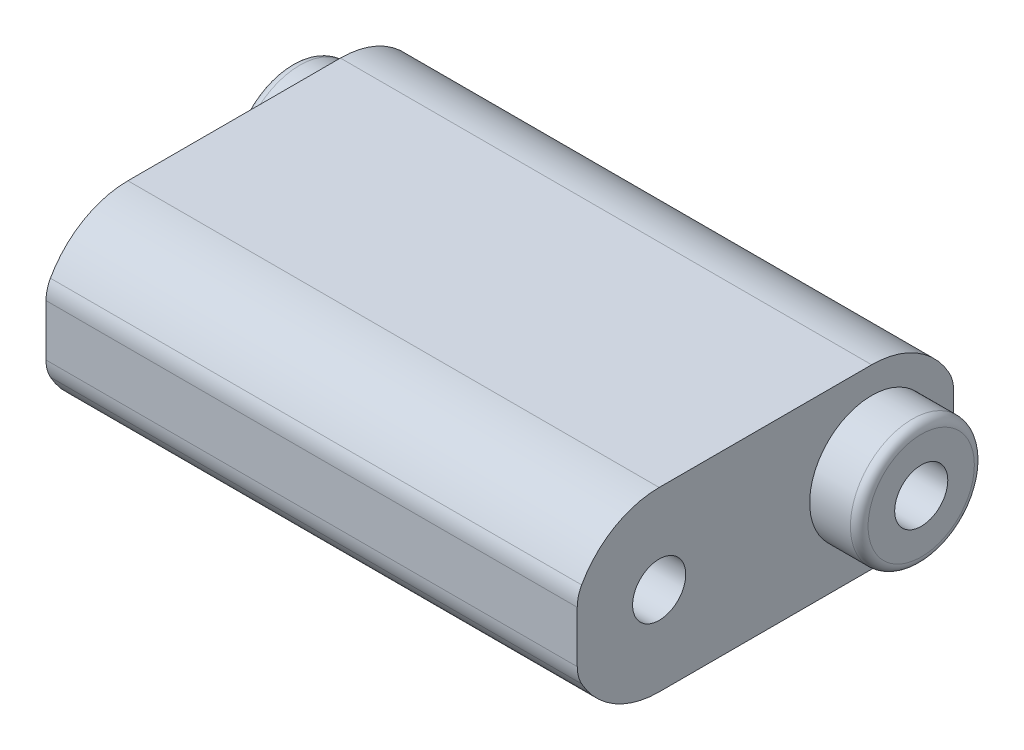
ISO-10303-21;
HEADER;
FILE_DESCRIPTION(('STEP AP214'),'2;1');
FILE_NAME('part.step','',(''),(''),'','','');
FILE_SCHEMA(('AUTOMOTIVE_DESIGN { 1 0 10303 214 1 1 1 1 }'));
ENDSEC;
DATA;
#1=APPLICATION_CONTEXT('core data for automotive mechanical design processes');
#2=APPLICATION_PROTOCOL_DEFINITION('international standard','automotive_design',2000,#1);
#3=PRODUCT_CONTEXT('',#1,'mechanical');
#4=PRODUCT('Part','Part','',(#3));
#5=PRODUCT_RELATED_PRODUCT_CATEGORY('part','',(#4));
#6=PRODUCT_DEFINITION_FORMATION('','',#4);
#7=PRODUCT_DEFINITION_CONTEXT('part definition',#1,'design');
#8=PRODUCT_DEFINITION('design','',#6,#7);
#9=PRODUCT_DEFINITION_SHAPE('','',#8);
#10=(LENGTH_UNIT() NAMED_UNIT(*) SI_UNIT(.MILLI.,.METRE.));
#11=(NAMED_UNIT(*) PLANE_ANGLE_UNIT() SI_UNIT($,.RADIAN.));
#12=(NAMED_UNIT(*) SI_UNIT($,.STERADIAN.) SOLID_ANGLE_UNIT());
#13=UNCERTAINTY_MEASURE_WITH_UNIT(LENGTH_MEASURE(1.E-05),#10,'distance_accuracy_value','');
#14=(GEOMETRIC_REPRESENTATION_CONTEXT(3) GLOBAL_UNCERTAINTY_ASSIGNED_CONTEXT((#13)) GLOBAL_UNIT_ASSIGNED_CONTEXT((#10,
#11,#12)) REPRESENTATION_CONTEXT('',''));
#15=CARTESIAN_POINT('',(0.,0.,0.));
#16=DIRECTION('',(0.,0.,1.));
#17=DIRECTION('',(1.,0.,0.));
#18=AXIS2_PLACEMENT_3D('',#15,#16,#17);
#19=CARTESIAN_POINT('',(300.,0.,0.));
#20=DIRECTION('',(1.,0.,0.));
#21=DIRECTION('',(0.,0.,-1.));
#22=AXIS2_PLACEMENT_3D('',#19,#20,#21);
#23=PLANE('',#22);
#24=DIRECTION('',(0.,-1.,0.));
#25=VECTOR('',#24,1.);
#26=CARTESIAN_POINT('',(300.,0.,106.249324319389));
#27=LINE('',#26,#25);
#28=CARTESIAN_POINT('',(300.,14.5249087011089,106.249324319389));
#29=VERTEX_POINT('',#28);
#30=CARTESIAN_POINT('',(300.,-14.5249087011089,106.249324319389));
#31=VERTEX_POINT('',#30);
#32=EDGE_CURVE('E171',#29,#31,#27,.T.);
#33=ORIENTED_EDGE('',*,*,#32,.T.);
#34=CARTESIAN_POINT('',(300.,-14.5249087011089,86.2493243193887));
#35=DIRECTION('',(1.,0.,0.));
#36=DIRECTION('',(0.,0.,-1.));
#37=AXIS2_PLACEMENT_3D('',#34,#35,#36);
#38=CIRCLE('',#37,20.);
#39=CARTESIAN_POINT('',(300.,-24.2081811685148,103.748873865648));
#40=VERTEX_POINT('',#39);
#41=EDGE_CURVE('E140',#31,#40,#38,.T.);
#42=ORIENTED_EDGE('',*,*,#41,.T.);
#43=CARTESIAN_POINT('',(300.,0.,60.));
#44=DIRECTION('',(1.,0.,0.));
#45=DIRECTION('',(0.,0.,-1.));
#46=AXIS2_PLACEMENT_3D('',#43,#44,#45);
#47=CIRCLE('',#46,50.);
#48=CARTESIAN_POINT('',(300.,-50.,60.));
#49=VERTEX_POINT('',#48);
#50=EDGE_CURVE('E132',#40,#49,#47,.T.);
#51=ORIENTED_EDGE('',*,*,#50,.T.);
#52=DIRECTION('',(0.,0.,1.));
#53=VECTOR('',#52,1.);
#54=CARTESIAN_POINT('',(300.,-50.,0.));
#55=LINE('',#54,#53);
#56=CARTESIAN_POINT('',(300.,-50.,-60.));
#57=VERTEX_POINT('',#56);
#58=EDGE_CURVE('E138',#57,#49,#55,.T.);
#59=ORIENTED_EDGE('',*,*,#58,.F.);
#60=CARTESIAN_POINT('',(300.,0.,-60.));
#61=DIRECTION('',(1.,0.,0.));
#62=DIRECTION('',(0.,0.,-1.));
#63=AXIS2_PLACEMENT_3D('',#60,#61,#62);
#64=CIRCLE('',#63,50.);
#65=CARTESIAN_POINT('',(300.,-24.2081811685148,-103.748873865648));
#66=VERTEX_POINT('',#65);
#67=EDGE_CURVE('E160',#57,#66,#64,.T.);
#68=ORIENTED_EDGE('',*,*,#67,.T.);
#69=CARTESIAN_POINT('',(300.,-14.5249087011089,-86.2493243193887));
#70=DIRECTION('',(1.,0.,0.));
#71=DIRECTION('',(0.,0.,-1.));
#72=AXIS2_PLACEMENT_3D('',#69,#70,#71);
#73=CIRCLE('',#72,20.);
#74=CARTESIAN_POINT('',(300.,-14.5249087011089,-106.249324319389));
#75=VERTEX_POINT('',#74);
#76=EDGE_CURVE('E226',#66,#75,#73,.T.);
#77=ORIENTED_EDGE('',*,*,#76,.T.);
#78=DIRECTION('',(0.,-1.,0.));
#79=VECTOR('',#78,1.);
#80=CARTESIAN_POINT('',(300.,0.,-106.249324319389));
#81=LINE('',#80,#79);
#82=CARTESIAN_POINT('',(300.,14.5249087011089,-106.249324319389));
#83=VERTEX_POINT('',#82);
#84=EDGE_CURVE('E162',#83,#75,#81,.T.);
#85=ORIENTED_EDGE('',*,*,#84,.F.);
#86=CARTESIAN_POINT('',(300.,14.5249087011089,-86.2493243193887));
#87=DIRECTION('',(1.,0.,0.));
#88=DIRECTION('',(0.,0.,-1.));
#89=AXIS2_PLACEMENT_3D('',#86,#87,#88);
#90=CIRCLE('',#89,20.);
#91=CARTESIAN_POINT('',(300.,24.2081811685149,-103.748873865648));
#92=VERTEX_POINT('',#91);
#93=EDGE_CURVE('E64',#83,#92,#90,.T.);
#94=ORIENTED_EDGE('',*,*,#93,.T.);
#95=CARTESIAN_POINT('',(300.,50.,-60.));
#96=VERTEX_POINT('',#95);
#97=EDGE_CURVE('E164',#92,#96,#64,.T.);
#98=ORIENTED_EDGE('',*,*,#97,.T.);
#99=DIRECTION('',(0.,0.,1.));
#100=VECTOR('',#99,1.);
#101=CARTESIAN_POINT('',(300.,50.,0.));
#102=LINE('',#101,#100);
#103=CARTESIAN_POINT('',(300.,50.,60.));
#104=VERTEX_POINT('',#103);
#105=EDGE_CURVE('E169',#96,#104,#102,.T.);
#106=ORIENTED_EDGE('',*,*,#105,.T.);
#107=CARTESIAN_POINT('',(300.,24.2081811685148,103.748873865648));
#108=VERTEX_POINT('',#107);
#109=EDGE_CURVE('E146',#104,#108,#47,.T.);
#110=ORIENTED_EDGE('',*,*,#109,.T.);
#111=CARTESIAN_POINT('',(300.,14.5249087011089,86.2493243193887));
#112=DIRECTION('',(1.,0.,0.));
#113=DIRECTION('',(0.,0.,-1.));
#114=AXIS2_PLACEMENT_3D('',#111,#112,#113);
#115=CIRCLE('',#114,20.);
#116=EDGE_CURVE('E228',#108,#29,#115,.T.);
#117=ORIENTED_EDGE('',*,*,#116,.T.);
#118=EDGE_LOOP('',(#33,#42,#51,#59,#68,#77,#85,#94,#98,#106,#110,#117));
#119=FACE_BOUND('',#118,.T.);
#120=CARTESIAN_POINT('',(300.,0.,60.));
#121=DIRECTION('',(-1.,0.,0.));
#122=DIRECTION('',(0.,0.,1.));
#123=AXIS2_PLACEMENT_3D('',#120,#121,#122);
#124=CIRCLE('',#123,15.);
#125=CARTESIAN_POINT('',(300.,0.,75.));
#126=VERTEX_POINT('',#125);
#127=EDGE_CURVE('E176',#126,#126,#124,.T.);
#128=ORIENTED_EDGE('',*,*,#127,.T.);
#129=EDGE_LOOP('',(#128));
#130=FACE_BOUND('',#129,.T.);
#131=CARTESIAN_POINT('',(300.,0.,-60.));
#132=DIRECTION('',(1.,0.,0.));
#133=DIRECTION('',(0.,0.,-1.));
#134=AXIS2_PLACEMENT_3D('',#131,#132,#133);
#135=CIRCLE('',#134,35.);
#136=CARTESIAN_POINT('',(300.,0.,-95.));
#137=VERTEX_POINT('',#136);
#138=EDGE_CURVE('E315',#137,#137,#135,.T.);
#139=ORIENTED_EDGE('',*,*,#138,.F.);
#140=EDGE_LOOP('',(#139));
#141=FACE_BOUND('',#140,.T.);
#142=ADVANCED_FACE('F41',(#119,#130,#141),#23,.T.);
#143=CARTESIAN_POINT('',(0.,0.,0.));
#144=DIRECTION('',(1.,0.,0.));
#145=DIRECTION('',(0.,0.,-1.));
#146=AXIS2_PLACEMENT_3D('',#143,#144,#145);
#147=PLANE('',#146);
#148=CARTESIAN_POINT('',(0.,0.,60.));
#149=DIRECTION('',(1.,0.,0.));
#150=DIRECTION('',(0.,0.,-1.));
#151=AXIS2_PLACEMENT_3D('',#148,#149,#150);
#152=CIRCLE('',#151,50.);
#153=CARTESIAN_POINT('',(0.,-24.2081811685148,103.748873865648));
#154=VERTEX_POINT('',#153);
#155=CARTESIAN_POINT('',(0.,-50.,60.));
#156=VERTEX_POINT('',#155);
#157=EDGE_CURVE('E151',#154,#156,#152,.T.);
#158=ORIENTED_EDGE('',*,*,#157,.F.);
#159=CARTESIAN_POINT('',(0.,-14.5249087011089,86.2493243193887));
#160=DIRECTION('',(1.,0.,0.));
#161=DIRECTION('',(0.,0.,-1.));
#162=AXIS2_PLACEMENT_3D('',#159,#160,#161);
#163=CIRCLE('',#162,20.);
#164=CARTESIAN_POINT('',(0.,-14.5249087011089,106.249324319389));
#165=VERTEX_POINT('',#164);
#166=EDGE_CURVE('E218',#154,#165,#163,.F.);
#167=ORIENTED_EDGE('',*,*,#166,.T.);
#168=DIRECTION('',(0.,-1.,0.));
#169=VECTOR('',#168,1.);
#170=CARTESIAN_POINT('',(0.,0.,106.249324319389));
#171=LINE('',#170,#169);
#172=CARTESIAN_POINT('',(0.,14.5249087011089,106.249324319389));
#173=VERTEX_POINT('',#172);
#174=EDGE_CURVE('E144',#173,#165,#171,.T.);
#175=ORIENTED_EDGE('',*,*,#174,.F.);
#176=CARTESIAN_POINT('',(0.,14.5249087011089,86.2493243193887));
#177=DIRECTION('',(1.,0.,0.));
#178=DIRECTION('',(0.,0.,-1.));
#179=AXIS2_PLACEMENT_3D('',#176,#177,#178);
#180=CIRCLE('',#179,20.);
#181=CARTESIAN_POINT('',(0.,24.2081811685148,103.748873865648));
#182=VERTEX_POINT('',#181);
#183=EDGE_CURVE('E216',#173,#182,#180,.F.);
#184=ORIENTED_EDGE('',*,*,#183,.T.);
#185=CARTESIAN_POINT('',(0.,50.,60.));
#186=VERTEX_POINT('',#185);
#187=EDGE_CURVE('E177',#186,#182,#152,.T.);
#188=ORIENTED_EDGE('',*,*,#187,.F.);
#189=DIRECTION('',(0.,0.,1.));
#190=VECTOR('',#189,1.);
#191=CARTESIAN_POINT('',(0.,50.,0.));
#192=LINE('',#191,#190);
#193=CARTESIAN_POINT('',(0.,50.,-60.));
#194=VERTEX_POINT('',#193);
#195=EDGE_CURVE('E186',#194,#186,#192,.T.);
#196=ORIENTED_EDGE('',*,*,#195,.F.);
#197=CARTESIAN_POINT('',(0.,0.,-60.));
#198=DIRECTION('',(1.,0.,0.));
#199=DIRECTION('',(0.,0.,-1.));
#200=AXIS2_PLACEMENT_3D('',#197,#198,#199);
#201=CIRCLE('',#200,50.);
#202=CARTESIAN_POINT('',(0.,24.2081811685149,-103.748873865648));
#203=VERTEX_POINT('',#202);
#204=EDGE_CURVE('E183',#203,#194,#201,.T.);
#205=ORIENTED_EDGE('',*,*,#204,.F.);
#206=CARTESIAN_POINT('',(0.,14.5249087011089,-86.2493243193887));
#207=DIRECTION('',(1.,0.,0.));
#208=DIRECTION('',(0.,0.,-1.));
#209=AXIS2_PLACEMENT_3D('',#206,#207,#208);
#210=CIRCLE('',#209,20.);
#211=CARTESIAN_POINT('',(0.,14.5249087011089,-106.249324319389));
#212=VERTEX_POINT('',#211);
#213=EDGE_CURVE('E212',#203,#212,#210,.F.);
#214=ORIENTED_EDGE('',*,*,#213,.T.);
#215=DIRECTION('',(0.,-1.,0.));
#216=VECTOR('',#215,1.);
#217=CARTESIAN_POINT('',(0.,0.,-106.249324319389));
#218=LINE('',#217,#216);
#219=CARTESIAN_POINT('',(0.,-14.5249087011089,-106.249324319389));
#220=VERTEX_POINT('',#219);
#221=EDGE_CURVE('E182',#212,#220,#218,.T.);
#222=ORIENTED_EDGE('',*,*,#221,.T.);
#223=CARTESIAN_POINT('',(0.,-14.5249087011089,-86.2493243193887));
#224=DIRECTION('',(1.,0.,0.));
#225=DIRECTION('',(0.,0.,-1.));
#226=AXIS2_PLACEMENT_3D('',#223,#224,#225);
#227=CIRCLE('',#226,20.);
#228=CARTESIAN_POINT('',(0.,-24.2081811685148,-103.748873865648));
#229=VERTEX_POINT('',#228);
#230=EDGE_CURVE('E214',#220,#229,#227,.F.);
#231=ORIENTED_EDGE('',*,*,#230,.T.);
#232=CARTESIAN_POINT('',(0.,-50.,-60.));
#233=VERTEX_POINT('',#232);
#234=EDGE_CURVE('E179',#233,#229,#201,.T.);
#235=ORIENTED_EDGE('',*,*,#234,.F.);
#236=DIRECTION('',(0.,0.,1.));
#237=VECTOR('',#236,1.);
#238=CARTESIAN_POINT('',(0.,-50.,0.));
#239=LINE('',#238,#237);
#240=EDGE_CURVE('E175',#233,#156,#239,.T.);
#241=ORIENTED_EDGE('',*,*,#240,.T.);
#242=EDGE_LOOP('',(#158,#167,#175,#184,#188,#196,#205,#214,#222,#231,#235,#241));
#243=FACE_BOUND('',#242,.T.);
#244=CARTESIAN_POINT('',(0.,0.,60.));
#245=DIRECTION('',(-1.,0.,0.));
#246=DIRECTION('',(0.,0.,1.));
#247=AXIS2_PLACEMENT_3D('',#244,#245,#246);
#248=CIRCLE('',#247,15.);
#249=CARTESIAN_POINT('',(0.,0.,75.));
#250=VERTEX_POINT('',#249);
#251=EDGE_CURVE('E323',#250,#250,#248,.T.);
#252=ORIENTED_EDGE('',*,*,#251,.F.);
#253=EDGE_LOOP('',(#252));
#254=FACE_BOUND('',#253,.T.);
#255=CARTESIAN_POINT('',(0.,0.,-60.));
#256=DIRECTION('',(1.,0.,0.));
#257=DIRECTION('',(0.,0.,-1.));
#258=AXIS2_PLACEMENT_3D('',#255,#256,#257);
#259=CIRCLE('',#258,35.);
#260=CARTESIAN_POINT('',(0.,0.,-95.));
#261=VERTEX_POINT('',#260);
#262=EDGE_CURVE('E155',#261,#261,#259,.F.);
#263=ORIENTED_EDGE('',*,*,#262,.F.);
#264=EDGE_LOOP('',(#263));
#265=FACE_BOUND('',#264,.T.);
#266=ADVANCED_FACE('F249',(#243,#254,#265),#147,.F.);
#267=CARTESIAN_POINT('',(300.,0.,60.));
#268=DIRECTION('',(-1.,0.,0.));
#269=DIRECTION('',(0.,0.,1.));
#270=AXIS2_PLACEMENT_3D('',#267,#268,#269);
#271=CYLINDRICAL_SURFACE('',#270,50.);
#272=ORIENTED_EDGE('',*,*,#50,.F.);
#273=DIRECTION('',(-1.,0.,0.));
#274=VECTOR('',#273,1.);
#275=CARTESIAN_POINT('',(300.,-24.2081811685148,103.748873865648));
#276=LINE('',#275,#274);
#277=EDGE_CURVE('E210',#40,#154,#276,.T.);
#278=ORIENTED_EDGE('',*,*,#277,.T.);
#279=ORIENTED_EDGE('',*,*,#157,.T.);
#280=DIRECTION('',(-1.,0.,0.));
#281=VECTOR('',#280,1.);
#282=CARTESIAN_POINT('',(300.,-50.,60.));
#283=LINE('',#282,#281);
#284=EDGE_CURVE('E148',#49,#156,#283,.T.);
#285=ORIENTED_EDGE('',*,*,#284,.F.);
#286=EDGE_LOOP('',(#272,#278,#279,#285));
#287=FACE_BOUND('',#286,.T.);
#288=ADVANCED_FACE('F149',(#287),#271,.T.);
#289=CARTESIAN_POINT('',(300.,-50.,0.));
#290=DIRECTION('',(0.,-1.,0.));
#291=DIRECTION('',(0.,0.,-1.));
#292=AXIS2_PLACEMENT_3D('',#289,#290,#291);
#293=PLANE('',#292);
#294=ORIENTED_EDGE('',*,*,#240,.F.);
#295=DIRECTION('',(-1.,0.,0.));
#296=VECTOR('',#295,1.);
#297=CARTESIAN_POINT('',(300.,-50.,-60.));
#298=LINE('',#297,#296);
#299=EDGE_CURVE('E156',#57,#233,#298,.T.);
#300=ORIENTED_EDGE('',*,*,#299,.F.);
#301=ORIENTED_EDGE('',*,*,#58,.T.);
#302=ORIENTED_EDGE('',*,*,#284,.T.);
#303=EDGE_LOOP('',(#294,#300,#301,#302));
#304=FACE_BOUND('',#303,.T.);
#305=ADVANCED_FACE('F158',(#304),#293,.T.);
#306=CARTESIAN_POINT('',(300.,0.,-60.));
#307=DIRECTION('',(-1.,0.,0.));
#308=DIRECTION('',(0.,0.,1.));
#309=AXIS2_PLACEMENT_3D('',#306,#307,#308);
#310=CYLINDRICAL_SURFACE('',#309,50.);
#311=ORIENTED_EDGE('',*,*,#234,.T.);
#312=DIRECTION('',(-1.,0.,0.));
#313=VECTOR('',#312,1.);
#314=CARTESIAN_POINT('',(300.,-24.2081811685148,-103.748873865648));
#315=LINE('',#314,#313);
#316=EDGE_CURVE('E49',#229,#66,#315,.F.);
#317=ORIENTED_EDGE('',*,*,#316,.T.);
#318=ORIENTED_EDGE('',*,*,#67,.F.);
#319=ORIENTED_EDGE('',*,*,#299,.T.);
#320=EDGE_LOOP('',(#311,#317,#318,#319));
#321=FACE_BOUND('',#320,.T.);
#322=ADVANCED_FACE('F238',(#321),#310,.T.);
#323=CARTESIAN_POINT('',(300.,0.,-106.249324319389));
#324=DIRECTION('',(0.,0.,-1.));
#325=DIRECTION('',(0.,1.,0.));
#326=AXIS2_PLACEMENT_3D('',#323,#324,#325);
#327=PLANE('',#326);
#328=ORIENTED_EDGE('',*,*,#84,.T.);
#329=DIRECTION('',(1.,0.,0.));
#330=VECTOR('',#329,1.);
#331=CARTESIAN_POINT('',(0.,-14.5249087011089,-106.249324319389));
#332=LINE('',#331,#330);
#333=EDGE_CURVE('E234',#75,#220,#332,.F.);
#334=ORIENTED_EDGE('',*,*,#333,.T.);
#335=ORIENTED_EDGE('',*,*,#221,.F.);
#336=DIRECTION('',(1.,0.,0.));
#337=VECTOR('',#336,1.);
#338=CARTESIAN_POINT('',(300.,14.5249087011089,-106.249324319389));
#339=LINE('',#338,#337);
#340=EDGE_CURVE('E232',#212,#83,#339,.T.);
#341=ORIENTED_EDGE('',*,*,#340,.T.);
#342=EDGE_LOOP('',(#328,#334,#335,#341));
#343=FACE_BOUND('',#342,.T.);
#344=ADVANCED_FACE('F246',(#343),#327,.T.);
#345=ORIENTED_EDGE('',*,*,#97,.F.);
#346=DIRECTION('',(-1.,0.,0.));
#347=VECTOR('',#346,1.);
#348=CARTESIAN_POINT('',(300.,24.2081811685149,-103.748873865648));
#349=LINE('',#348,#347);
#350=EDGE_CURVE('E11',#92,#203,#349,.T.);
#351=ORIENTED_EDGE('',*,*,#350,.T.);
#352=ORIENTED_EDGE('',*,*,#204,.T.);
#353=DIRECTION('',(-1.,0.,0.));
#354=VECTOR('',#353,1.);
#355=CARTESIAN_POINT('',(300.,50.,-60.));
#356=LINE('',#355,#354);
#357=EDGE_CURVE('E192',#96,#194,#356,.T.);
#358=ORIENTED_EDGE('',*,*,#357,.F.);
#359=EDGE_LOOP('',(#345,#351,#352,#358));
#360=FACE_BOUND('',#359,.T.);
#361=ADVANCED_FACE('F256',(#360),#310,.T.);
#362=CARTESIAN_POINT('',(300.,50.,0.));
#363=DIRECTION('',(0.,-1.,0.));
#364=DIRECTION('',(0.,0.,-1.));
#365=AXIS2_PLACEMENT_3D('',#362,#363,#364);
#366=PLANE('',#365);
#367=ORIENTED_EDGE('',*,*,#195,.T.);
#368=DIRECTION('',(-1.,0.,0.));
#369=VECTOR('',#368,1.);
#370=CARTESIAN_POINT('',(300.,50.,60.));
#371=LINE('',#370,#369);
#372=EDGE_CURVE('E173',#104,#186,#371,.T.);
#373=ORIENTED_EDGE('',*,*,#372,.F.);
#374=ORIENTED_EDGE('',*,*,#105,.F.);
#375=ORIENTED_EDGE('',*,*,#357,.T.);
#376=EDGE_LOOP('',(#367,#373,#374,#375));
#377=FACE_BOUND('',#376,.T.);
#378=ADVANCED_FACE('F262',(#377),#366,.F.);
#379=ORIENTED_EDGE('',*,*,#187,.T.);
#380=DIRECTION('',(-1.,0.,0.));
#381=VECTOR('',#380,1.);
#382=CARTESIAN_POINT('',(300.,24.2081811685149,103.748873865648));
#383=LINE('',#382,#381);
#384=EDGE_CURVE('E56',#182,#108,#383,.F.);
#385=ORIENTED_EDGE('',*,*,#384,.T.);
#386=ORIENTED_EDGE('',*,*,#109,.F.);
#387=ORIENTED_EDGE('',*,*,#372,.T.);
#388=EDGE_LOOP('',(#379,#385,#386,#387));
#389=FACE_BOUND('',#388,.T.);
#390=ADVANCED_FACE('F264',(#389),#271,.T.);
#391=CARTESIAN_POINT('',(300.,0.,106.249324319389));
#392=DIRECTION('',(0.,0.,-1.));
#393=DIRECTION('',(0.,1.,0.));
#394=AXIS2_PLACEMENT_3D('',#391,#392,#393);
#395=PLANE('',#394);
#396=ORIENTED_EDGE('',*,*,#174,.T.);
#397=DIRECTION('',(-1.,0.,0.));
#398=VECTOR('',#397,1.);
#399=CARTESIAN_POINT('',(300.,-14.5249087011089,106.249324319389));
#400=LINE('',#399,#398);
#401=EDGE_CURVE('E223',#165,#31,#400,.F.);
#402=ORIENTED_EDGE('',*,*,#401,.T.);
#403=ORIENTED_EDGE('',*,*,#32,.F.);
#404=DIRECTION('',(-1.,0.,0.));
#405=VECTOR('',#404,1.);
#406=CARTESIAN_POINT('',(300.,14.5249087011089,106.249324319389));
#407=LINE('',#406,#405);
#408=EDGE_CURVE('E220',#29,#173,#407,.T.);
#409=ORIENTED_EDGE('',*,*,#408,.T.);
#410=EDGE_LOOP('',(#396,#402,#403,#409));
#411=FACE_BOUND('',#410,.T.);
#412=ADVANCED_FACE('F266',(#411),#395,.F.);
#413=CARTESIAN_POINT('',(300.,0.,-60.));
#414=DIRECTION('',(-1.,0.,0.));
#415=DIRECTION('',(0.,0.,1.));
#416=AXIS2_PLACEMENT_3D('',#413,#414,#415);
#417=CYLINDRICAL_SURFACE('',#416,15.);
#418=CARTESIAN_POINT('',(-28.,0.,-60.));
#419=DIRECTION('',(-1.,0.,0.));
#420=DIRECTION('',(0.,0.,1.));
#421=AXIS2_PLACEMENT_3D('',#418,#419,#420);
#422=CIRCLE('',#421,15.);
#423=CARTESIAN_POINT('',(-28.,0.,-45.));
#424=VERTEX_POINT('',#423);
#425=EDGE_CURVE('E318',#424,#424,#422,.T.);
#426=ORIENTED_EDGE('',*,*,#425,.T.);
#427=EDGE_LOOP('',(#426));
#428=FACE_BOUND('',#427,.T.);
#429=CARTESIAN_POINT('',(328.,0.,-60.));
#430=DIRECTION('',(1.,0.,0.));
#431=DIRECTION('',(0.,0.,-1.));
#432=AXIS2_PLACEMENT_3D('',#429,#430,#431);
#433=CIRCLE('',#432,15.);
#434=CARTESIAN_POINT('',(328.,0.,-75.));
#435=VERTEX_POINT('',#434);
#436=EDGE_CURVE('E313',#435,#435,#433,.T.);
#437=ORIENTED_EDGE('',*,*,#436,.T.);
#438=EDGE_LOOP('',(#437));
#439=FACE_BOUND('',#438,.T.);
#440=ADVANCED_FACE('F272',(#428,#439),#417,.F.);
#441=CARTESIAN_POINT('',(300.,0.,60.));
#442=DIRECTION('',(-1.,0.,0.));
#443=DIRECTION('',(0.,0.,1.));
#444=AXIS2_PLACEMENT_3D('',#441,#442,#443);
#445=CYLINDRICAL_SURFACE('',#444,15.);
#446=ORIENTED_EDGE('',*,*,#127,.F.);
#447=EDGE_LOOP('',(#446));
#448=FACE_BOUND('',#447,.T.);
#449=ORIENTED_EDGE('',*,*,#251,.T.);
#450=EDGE_LOOP('',(#449));
#451=FACE_BOUND('',#450,.T.);
#452=ADVANCED_FACE('F286',(#448,#451),#445,.F.);
#453=CARTESIAN_POINT('',(-28.,0.,-60.));
#454=DIRECTION('',(-1.,0.,0.));
#455=DIRECTION('',(0.,0.,1.));
#456=AXIS2_PLACEMENT_3D('',#453,#454,#455);
#457=PLANE('',#456);
#458=CARTESIAN_POINT('',(-28.,0.,-60.));
#459=DIRECTION('',(-1.,0.,0.));
#460=DIRECTION('',(0.,0.,1.));
#461=AXIS2_PLACEMENT_3D('',#458,#459,#460);
#462=CIRCLE('',#461,30.);
#463=CARTESIAN_POINT('',(-28.,0.,-30.));
#464=VERTEX_POINT('',#463);
#465=EDGE_CURVE('E198',#464,#464,#462,.T.);
#466=ORIENTED_EDGE('',*,*,#465,.T.);
#467=EDGE_LOOP('',(#466));
#468=FACE_BOUND('',#467,.T.);
#469=ORIENTED_EDGE('',*,*,#425,.F.);
#470=EDGE_LOOP('',(#469));
#471=FACE_BOUND('',#470,.T.);
#472=ADVANCED_FACE('F290',(#468,#471),#457,.T.);
#473=CARTESIAN_POINT('',(-28.,0.,-60.));
#474=DIRECTION('',(1.,0.,0.));
#475=DIRECTION('',(0.,0.,-1.));
#476=AXIS2_PLACEMENT_3D('',#473,#474,#475);
#477=CYLINDRICAL_SURFACE('',#476,35.);
#478=CARTESIAN_POINT('',(-23.,0.,-60.));
#479=DIRECTION('',(-1.,0.,0.));
#480=DIRECTION('',(0.,0.,1.));
#481=AXIS2_PLACEMENT_3D('',#478,#479,#480);
#482=CIRCLE('',#481,35.);
#483=CARTESIAN_POINT('',(-23.,0.,-25.));
#484=VERTEX_POINT('',#483);
#485=EDGE_CURVE('E201',#484,#484,#482,.F.);
#486=ORIENTED_EDGE('',*,*,#485,.T.);
#487=EDGE_LOOP('',(#486));
#488=FACE_BOUND('',#487,.T.);
#489=ORIENTED_EDGE('',*,*,#262,.T.);
#490=EDGE_LOOP('',(#489));
#491=FACE_BOUND('',#490,.T.);
#492=ADVANCED_FACE('F292',(#488,#491),#477,.T.);
#493=CARTESIAN_POINT('',(328.,0.,-60.));
#494=DIRECTION('',(1.,0.,0.));
#495=DIRECTION('',(0.,0.,-1.));
#496=AXIS2_PLACEMENT_3D('',#493,#494,#495);
#497=PLANE('',#496);
#498=CARTESIAN_POINT('',(328.,0.,-60.));
#499=DIRECTION('',(1.,0.,0.));
#500=DIRECTION('',(0.,0.,-1.));
#501=AXIS2_PLACEMENT_3D('',#498,#499,#500);
#502=CIRCLE('',#501,30.);
#503=CARTESIAN_POINT('',(328.,0.,-90.));
#504=VERTEX_POINT('',#503);
#505=EDGE_CURVE('E204',#504,#504,#502,.T.);
#506=ORIENTED_EDGE('',*,*,#505,.T.);
#507=EDGE_LOOP('',(#506));
#508=FACE_BOUND('',#507,.T.);
#509=ORIENTED_EDGE('',*,*,#436,.F.);
#510=EDGE_LOOP('',(#509));
#511=FACE_BOUND('',#510,.T.);
#512=ADVANCED_FACE('F295',(#508,#511),#497,.T.);
#513=CARTESIAN_POINT('',(328.,0.,-60.));
#514=DIRECTION('',(-1.,0.,0.));
#515=DIRECTION('',(0.,0.,1.));
#516=AXIS2_PLACEMENT_3D('',#513,#514,#515);
#517=CYLINDRICAL_SURFACE('',#516,35.);
#518=CARTESIAN_POINT('',(323.,0.,-60.));
#519=DIRECTION('',(1.,0.,0.));
#520=DIRECTION('',(0.,0.,-1.));
#521=AXIS2_PLACEMENT_3D('',#518,#519,#520);
#522=CIRCLE('',#521,35.);
#523=CARTESIAN_POINT('',(323.,0.,-95.));
#524=VERTEX_POINT('',#523);
#525=EDGE_CURVE('E207',#524,#524,#522,.F.);
#526=ORIENTED_EDGE('',*,*,#525,.T.);
#527=EDGE_LOOP('',(#526));
#528=FACE_BOUND('',#527,.T.);
#529=ORIENTED_EDGE('',*,*,#138,.T.);
#530=EDGE_LOOP('',(#529));
#531=FACE_BOUND('',#530,.T.);
#532=ADVANCED_FACE('F300',(#528,#531),#517,.T.);
#533=CARTESIAN_POINT('',(-23.,0.,-60.));
#534=DIRECTION('',(-1.,0.,0.));
#535=DIRECTION('',(0.,0.,1.));
#536=AXIS2_PLACEMENT_3D('',#533,#534,#535);
#537=TOROIDAL_SURFACE('',#536,30.,5.);
#538=ORIENTED_EDGE('',*,*,#485,.F.);
#539=EDGE_LOOP('',(#538));
#540=FACE_BOUND('',#539,.T.);
#541=ORIENTED_EDGE('',*,*,#465,.F.);
#542=EDGE_LOOP('',(#541));
#543=FACE_BOUND('',#542,.T.);
#544=ADVANCED_FACE('F303',(#540,#543),#537,.T.);
#545=CARTESIAN_POINT('',(323.,0.,-60.));
#546=DIRECTION('',(1.,0.,0.));
#547=DIRECTION('',(0.,0.,-1.));
#548=AXIS2_PLACEMENT_3D('',#545,#546,#547);
#549=TOROIDAL_SURFACE('',#548,30.,5.);
#550=ORIENTED_EDGE('',*,*,#525,.F.);
#551=EDGE_LOOP('',(#550));
#552=FACE_BOUND('',#551,.T.);
#553=ORIENTED_EDGE('',*,*,#505,.F.);
#554=EDGE_LOOP('',(#553));
#555=FACE_BOUND('',#554,.T.);
#556=ADVANCED_FACE('F338',(#552,#555),#549,.T.);
#557=CARTESIAN_POINT('',(300.,-14.5249087011089,86.2493243193887));
#558=DIRECTION('',(-1.,0.,0.));
#559=DIRECTION('',(0.,0.,1.));
#560=AXIS2_PLACEMENT_3D('',#557,#558,#559);
#561=CYLINDRICAL_SURFACE('',#560,20.);
#562=ORIENTED_EDGE('',*,*,#41,.F.);
#563=ORIENTED_EDGE('',*,*,#401,.F.);
#564=ORIENTED_EDGE('',*,*,#166,.F.);
#565=ORIENTED_EDGE('',*,*,#277,.F.);
#566=EDGE_LOOP('',(#562,#563,#564,#565));
#567=FACE_BOUND('',#566,.T.);
#568=ADVANCED_FACE('F340',(#567),#561,.T.);
#569=CARTESIAN_POINT('',(300.,14.5249087011089,86.2493243193887));
#570=DIRECTION('',(-1.,0.,0.));
#571=DIRECTION('',(0.,0.,1.));
#572=AXIS2_PLACEMENT_3D('',#569,#570,#571);
#573=CYLINDRICAL_SURFACE('',#572,20.);
#574=ORIENTED_EDGE('',*,*,#116,.F.);
#575=ORIENTED_EDGE('',*,*,#384,.F.);
#576=ORIENTED_EDGE('',*,*,#183,.F.);
#577=ORIENTED_EDGE('',*,*,#408,.F.);
#578=EDGE_LOOP('',(#574,#575,#576,#577));
#579=FACE_BOUND('',#578,.T.);
#580=ADVANCED_FACE('F347',(#579),#573,.T.);
#581=CARTESIAN_POINT('',(300.,-14.5249087011089,-86.2493243193887));
#582=DIRECTION('',(-1.,0.,0.));
#583=DIRECTION('',(0.,0.,1.));
#584=AXIS2_PLACEMENT_3D('',#581,#582,#583);
#585=CYLINDRICAL_SURFACE('',#584,20.);
#586=ORIENTED_EDGE('',*,*,#76,.F.);
#587=ORIENTED_EDGE('',*,*,#316,.F.);
#588=ORIENTED_EDGE('',*,*,#230,.F.);
#589=ORIENTED_EDGE('',*,*,#333,.F.);
#590=EDGE_LOOP('',(#586,#587,#588,#589));
#591=FACE_BOUND('',#590,.T.);
#592=ADVANCED_FACE('F243',(#591),#585,.T.);
#593=CARTESIAN_POINT('',(300.,14.5249087011089,-86.2493243193887));
#594=DIRECTION('',(-1.,0.,0.));
#595=DIRECTION('',(0.,0.,1.));
#596=AXIS2_PLACEMENT_3D('',#593,#594,#595);
#597=CYLINDRICAL_SURFACE('',#596,20.);
#598=ORIENTED_EDGE('',*,*,#93,.F.);
#599=ORIENTED_EDGE('',*,*,#340,.F.);
#600=ORIENTED_EDGE('',*,*,#213,.F.);
#601=ORIENTED_EDGE('',*,*,#350,.F.);
#602=EDGE_LOOP('',(#598,#599,#600,#601));
#603=FACE_BOUND('',#602,.T.);
#604=ADVANCED_FACE('F43',(#603),#597,.T.);
#605=CLOSED_SHELL('',(#142,#266,#288,#305,#322,#344,#361,#378,#390,#412,#440,#452,#472,#492,
#512,#532,#544,#556,#568,#580,#592,#604));
#606=MANIFOLD_SOLID_BREP('B2',#605);
#607=ADVANCED_BREP_SHAPE_REPRESENTATION('',(#18,#606),#14);
#608=SHAPE_DEFINITION_REPRESENTATION(#9,#607);
ENDSEC;
END-ISO-10303-21;
